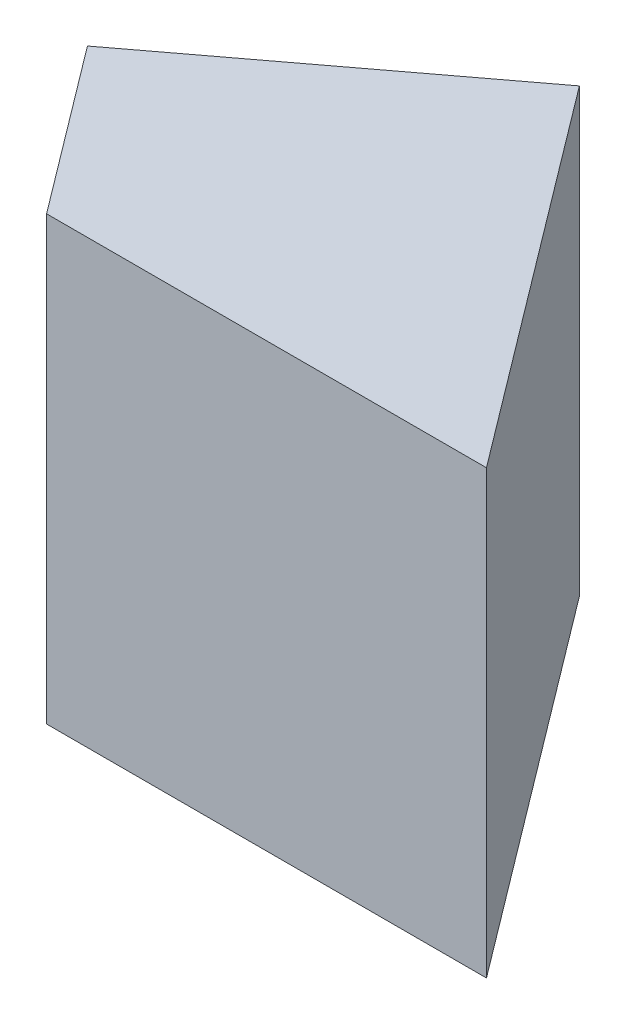
ISO-10303-21;
HEADER;
FILE_DESCRIPTION(('STEP AP214'),'2;1');
FILE_NAME('part.step','',(''),(''),'','','');
FILE_SCHEMA(('AUTOMOTIVE_DESIGN { 1 0 10303 214 1 1 1 1 }'));
ENDSEC;
DATA;
#1=APPLICATION_CONTEXT('core data for automotive mechanical design processes');
#2=APPLICATION_PROTOCOL_DEFINITION('international standard','automotive_design',2000,#1);
#3=PRODUCT_CONTEXT('',#1,'mechanical');
#4=PRODUCT('Part','Part','',(#3));
#5=PRODUCT_RELATED_PRODUCT_CATEGORY('part','',(#4));
#6=PRODUCT_DEFINITION_FORMATION('','',#4);
#7=PRODUCT_DEFINITION_CONTEXT('part definition',#1,'design');
#8=PRODUCT_DEFINITION('design','',#6,#7);
#9=PRODUCT_DEFINITION_SHAPE('','',#8);
#10=(LENGTH_UNIT() NAMED_UNIT(*) SI_UNIT(.MILLI.,.METRE.));
#11=(NAMED_UNIT(*) PLANE_ANGLE_UNIT() SI_UNIT($,.RADIAN.));
#12=(NAMED_UNIT(*) SI_UNIT($,.STERADIAN.) SOLID_ANGLE_UNIT());
#13=UNCERTAINTY_MEASURE_WITH_UNIT(LENGTH_MEASURE(1.E-05),#10,'distance_accuracy_value','');
#14=(GEOMETRIC_REPRESENTATION_CONTEXT(3) GLOBAL_UNCERTAINTY_ASSIGNED_CONTEXT((#13)) GLOBAL_UNIT_ASSIGNED_CONTEXT((#10,
#11,#12)) REPRESENTATION_CONTEXT('',''));
#15=CARTESIAN_POINT('',(0.,0.,0.));
#16=DIRECTION('',(0.,0.,1.));
#17=DIRECTION('',(1.,0.,0.));
#18=AXIS2_PLACEMENT_3D('',#15,#16,#17);
#19=CARTESIAN_POINT('',(-5.27517638722499,10.,7.50114113188246));
#20=DIRECTION('',(0.798635510047294,0.,-0.601815023152047));
#21=DIRECTION('',(-0.601815023152047,0.,-0.798635510047294));
#22=AXIS2_PLACEMENT_3D('',#19,#20,#21);
#23=PLANE('',#22);
#24=DIRECTION('',(0.601815023152047,0.,0.798635510047294));
#25=VECTOR('',#24,1.);
#26=CARTESIAN_POINT('',(-5.27517638722499,-10.,7.50114113188246));
#27=LINE('',#26,#25);
#28=CARTESIAN_POINT('',(-10.9276916675477,-10.,0.));
#29=VERTEX_POINT('',#28);
#30=CARTESIAN_POINT('',(-5.27517638722499,-10.,7.50114113188246));
#31=VERTEX_POINT('',#30);
#32=EDGE_CURVE('E97',#29,#31,#27,.T.);
#33=ORIENTED_EDGE('',*,*,#32,.T.);
#34=DIRECTION('',(0.,-1.,0.));
#35=VECTOR('',#34,1.);
#36=CARTESIAN_POINT('',(-5.27517638722499,10.,7.50114113188246));
#37=LINE('',#36,#35);
#38=CARTESIAN_POINT('',(-5.27517638722499,10.,7.50114113188246));
#39=VERTEX_POINT('',#38);
#40=EDGE_CURVE('E11',#39,#31,#37,.T.);
#41=ORIENTED_EDGE('',*,*,#40,.F.);
#42=DIRECTION('',(0.601815023152047,0.,0.798635510047294));
#43=VECTOR('',#42,1.);
#44=CARTESIAN_POINT('',(-5.27517638722499,10.,7.50114113188246));
#45=LINE('',#44,#43);
#46=CARTESIAN_POINT('',(-10.9276916675477,10.,0.));
#47=VERTEX_POINT('',#46);
#48=EDGE_CURVE('E85',#47,#39,#45,.T.);
#49=ORIENTED_EDGE('',*,*,#48,.F.);
#50=DIRECTION('',(0.,-1.,0.));
#51=VECTOR('',#50,1.);
#52=CARTESIAN_POINT('',(-10.9276916675477,10.,0.));
#53=LINE('',#52,#51);
#54=EDGE_CURVE('E93',#47,#29,#53,.T.);
#55=ORIENTED_EDGE('',*,*,#54,.T.);
#56=EDGE_LOOP('',(#33,#41,#49,#55));
#57=FACE_BOUND('',#56,.T.);
#58=ADVANCED_FACE('F34',(#57),#23,.F.);
#59=CARTESIAN_POINT('',(14.633780577459,10.,7.50114113188246));
#60=DIRECTION('',(0.,0.,-1.));
#61=DIRECTION('',(-1.,0.,0.));
#62=AXIS2_PLACEMENT_3D('',#59,#60,#61);
#63=PLANE('',#62);
#64=DIRECTION('',(1.,0.,0.));
#65=VECTOR('',#64,1.);
#66=CARTESIAN_POINT('',(14.633780577459,-10.,7.50114113188246));
#67=LINE('',#66,#65);
#68=CARTESIAN_POINT('',(14.633780577459,-10.,7.50114113188246));
#69=VERTEX_POINT('',#68);
#70=EDGE_CURVE('E89',#31,#69,#67,.T.);
#71=ORIENTED_EDGE('',*,*,#70,.T.);
#72=DIRECTION('',(0.,-1.,0.));
#73=VECTOR('',#72,1.);
#74=CARTESIAN_POINT('',(14.633780577459,10.,7.50114113188246));
#75=LINE('',#74,#73);
#76=CARTESIAN_POINT('',(14.633780577459,10.,7.50114113188246));
#77=VERTEX_POINT('',#76);
#78=EDGE_CURVE('E42',#77,#69,#75,.T.);
#79=ORIENTED_EDGE('',*,*,#78,.F.);
#80=DIRECTION('',(1.,0.,0.));
#81=VECTOR('',#80,1.);
#82=CARTESIAN_POINT('',(14.633780577459,10.,7.50114113188246));
#83=LINE('',#82,#81);
#84=EDGE_CURVE('E80',#39,#77,#83,.T.);
#85=ORIENTED_EDGE('',*,*,#84,.F.);
#86=ORIENTED_EDGE('',*,*,#40,.T.);
#87=EDGE_LOOP('',(#71,#79,#85,#86));
#88=FACE_BOUND('',#87,.T.);
#89=ADVANCED_FACE('F88',(#88),#63,.F.);
#90=CARTESIAN_POINT('',(1.77061294220432,10.,-9.56885886811754));
#91=DIRECTION('',(-0.798635510047294,0.,0.601815023152047));
#92=DIRECTION('',(0.601815023152047,0.,0.798635510047294));
#93=AXIS2_PLACEMENT_3D('',#90,#91,#92);
#94=PLANE('',#93);
#95=DIRECTION('',(-0.601815023152047,0.,-0.798635510047294));
#96=VECTOR('',#95,1.);
#97=CARTESIAN_POINT('',(1.77061294220432,-10.,-9.56885886811754));
#98=LINE('',#97,#96);
#99=CARTESIAN_POINT('',(1.77061294220432,-10.,-9.56885886811754));
#100=VERTEX_POINT('',#99);
#101=EDGE_CURVE('E67',#69,#100,#98,.T.);
#102=ORIENTED_EDGE('',*,*,#101,.T.);
#103=DIRECTION('',(0.,-1.,0.));
#104=VECTOR('',#103,1.);
#105=CARTESIAN_POINT('',(1.77061294220432,10.,-9.56885886811754));
#106=LINE('',#105,#104);
#107=CARTESIAN_POINT('',(1.77061294220432,10.,-9.56885886811754));
#108=VERTEX_POINT('',#107);
#109=EDGE_CURVE('E90',#108,#100,#106,.T.);
#110=ORIENTED_EDGE('',*,*,#109,.F.);
#111=DIRECTION('',(-0.601815023152047,0.,-0.798635510047294));
#112=VECTOR('',#111,1.);
#113=CARTESIAN_POINT('',(1.77061294220432,10.,-9.56885886811754));
#114=LINE('',#113,#112);
#115=EDGE_CURVE('E83',#77,#108,#114,.T.);
#116=ORIENTED_EDGE('',*,*,#115,.F.);
#117=ORIENTED_EDGE('',*,*,#78,.T.);
#118=EDGE_LOOP('',(#102,#110,#116,#117));
#119=FACE_BOUND('',#118,.T.);
#120=ADVANCED_FACE('F91',(#119),#94,.F.);
#121=CARTESIAN_POINT('',(-10.9276916675477,10.,0.));
#122=DIRECTION('',(0.601815023152047,0.,0.798635510047294));
#123=DIRECTION('',(0.798635510047294,0.,-0.601815023152047));
#124=AXIS2_PLACEMENT_3D('',#121,#122,#123);
#125=PLANE('',#124);
#126=DIRECTION('',(-0.798635510047294,0.,0.601815023152047));
#127=VECTOR('',#126,1.);
#128=CARTESIAN_POINT('',(-10.9276916675477,-10.,0.));
#129=LINE('',#128,#127);
#130=EDGE_CURVE('E73',#100,#29,#129,.T.);
#131=ORIENTED_EDGE('',*,*,#130,.T.);
#132=ORIENTED_EDGE('',*,*,#54,.F.);
#133=DIRECTION('',(-0.798635510047294,0.,0.601815023152047));
#134=VECTOR('',#133,1.);
#135=CARTESIAN_POINT('',(-10.9276916675477,10.,0.));
#136=LINE('',#135,#134);
#137=EDGE_CURVE('E50',#108,#47,#136,.T.);
#138=ORIENTED_EDGE('',*,*,#137,.F.);
#139=ORIENTED_EDGE('',*,*,#109,.T.);
#140=EDGE_LOOP('',(#131,#132,#138,#139));
#141=FACE_BOUND('',#140,.T.);
#142=ADVANCED_FACE('F104',(#141),#125,.F.);
#143=CARTESIAN_POINT('',(-10.9276916675477,10.,0.));
#144=DIRECTION('',(0.,-1.,0.));
#145=DIRECTION('',(0.,0.,-1.));
#146=AXIS2_PLACEMENT_3D('',#143,#144,#145);
#147=PLANE('',#146);
#148=ORIENTED_EDGE('',*,*,#48,.T.);
#149=ORIENTED_EDGE('',*,*,#84,.T.);
#150=ORIENTED_EDGE('',*,*,#115,.T.);
#151=ORIENTED_EDGE('',*,*,#137,.T.);
#152=EDGE_LOOP('',(#148,#149,#150,#151));
#153=FACE_BOUND('',#152,.T.);
#154=ADVANCED_FACE('F81',(#153),#147,.F.);
#155=CARTESIAN_POINT('',(-10.9276916675477,-10.,0.));
#156=DIRECTION('',(0.,-1.,0.));
#157=DIRECTION('',(0.,0.,-1.));
#158=AXIS2_PLACEMENT_3D('',#155,#156,#157);
#159=PLANE('',#158);
#160=ORIENTED_EDGE('',*,*,#32,.F.);
#161=ORIENTED_EDGE('',*,*,#130,.F.);
#162=ORIENTED_EDGE('',*,*,#101,.F.);
#163=ORIENTED_EDGE('',*,*,#70,.F.);
#164=EDGE_LOOP('',(#160,#161,#162,#163));
#165=FACE_BOUND('',#164,.T.);
#166=ADVANCED_FACE('F107',(#165),#159,.T.);
#167=CLOSED_SHELL('',(#58,#89,#120,#142,#154,#166));
#168=MANIFOLD_SOLID_BREP('B2',#167);
#169=ADVANCED_BREP_SHAPE_REPRESENTATION('',(#18,#168),#14);
#170=SHAPE_DEFINITION_REPRESENTATION(#9,#169);
ENDSEC;
END-ISO-10303-21;
